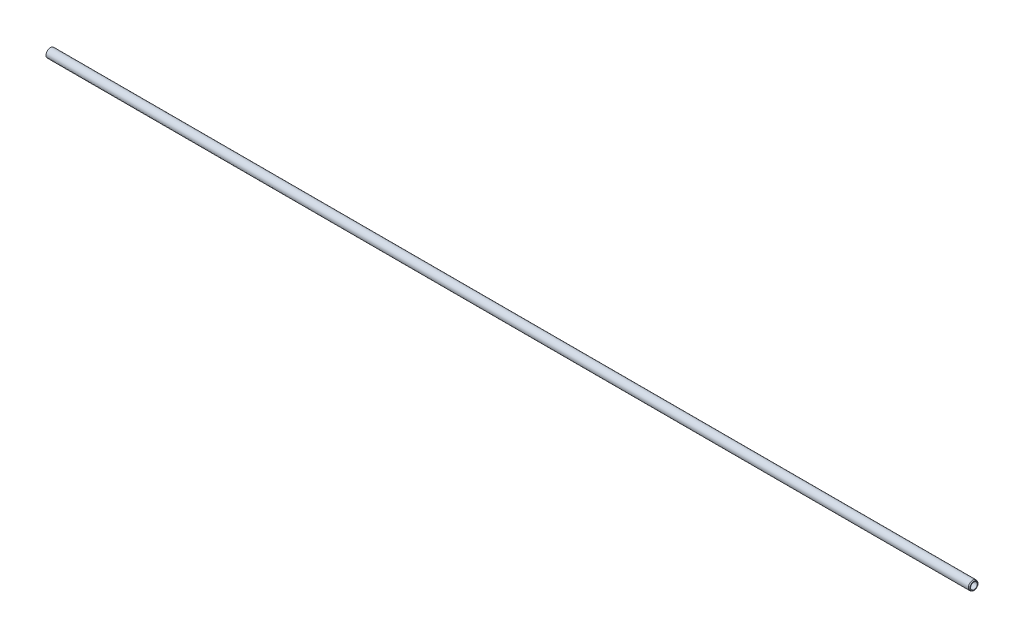
ISO-10303-21;
HEADER;
FILE_DESCRIPTION(('STEP AP214'),'2;1');
FILE_NAME('part.step','',(''),(''),'','','');
FILE_SCHEMA(('AUTOMOTIVE_DESIGN { 1 0 10303 214 1 1 1 1 }'));
ENDSEC;
DATA;
#1=APPLICATION_CONTEXT('core data for automotive mechanical design processes');
#2=APPLICATION_PROTOCOL_DEFINITION('international standard','automotive_design',2000,#1);
#3=PRODUCT_CONTEXT('',#1,'mechanical');
#4=PRODUCT('Part','Part','',(#3));
#5=PRODUCT_RELATED_PRODUCT_CATEGORY('part','',(#4));
#6=PRODUCT_DEFINITION_FORMATION('','',#4);
#7=PRODUCT_DEFINITION_CONTEXT('part definition',#1,'design');
#8=PRODUCT_DEFINITION('design','',#6,#7);
#9=PRODUCT_DEFINITION_SHAPE('','',#8);
#10=(LENGTH_UNIT() NAMED_UNIT(*) SI_UNIT(.MILLI.,.METRE.));
#11=(NAMED_UNIT(*) PLANE_ANGLE_UNIT() SI_UNIT($,.RADIAN.));
#12=(NAMED_UNIT(*) SI_UNIT($,.STERADIAN.) SOLID_ANGLE_UNIT());
#13=UNCERTAINTY_MEASURE_WITH_UNIT(LENGTH_MEASURE(1.E-05),#10,'distance_accuracy_value','');
#14=(GEOMETRIC_REPRESENTATION_CONTEXT(3) GLOBAL_UNCERTAINTY_ASSIGNED_CONTEXT((#13)) GLOBAL_UNIT_ASSIGNED_CONTEXT((#10,
#11,#12)) REPRESENTATION_CONTEXT('',''));
#15=CARTESIAN_POINT('',(0.,0.,0.));
#16=DIRECTION('',(0.,0.,1.));
#17=DIRECTION('',(1.,0.,0.));
#18=AXIS2_PLACEMENT_3D('',#15,#16,#17);
#19=CARTESIAN_POINT('',(0.,0.,0.));
#20=DIRECTION('',(-1.,0.,0.));
#21=DIRECTION('',(0.,0.,1.));
#22=AXIS2_PLACEMENT_3D('',#19,#20,#21);
#23=CYLINDRICAL_SURFACE('',#22,10.);
#24=CARTESIAN_POINT('',(2070.5,0.,0.));
#25=DIRECTION('',(-1.,0.,0.));
#26=DIRECTION('',(0.,0.,1.));
#27=AXIS2_PLACEMENT_3D('',#24,#25,#26);
#28=CIRCLE('',#27,10.);
#29=CARTESIAN_POINT('',(2070.5,0.,10.));
#30=VERTEX_POINT('',#29);
#31=EDGE_CURVE('E10',#30,#30,#28,.T.);
#32=ORIENTED_EDGE('',*,*,#31,.T.);
#33=EDGE_LOOP('',(#32));
#34=FACE_BOUND('',#33,.T.);
#35=CARTESIAN_POINT('',(0.,0.,0.));
#36=DIRECTION('',(-1.,0.,0.));
#37=DIRECTION('',(0.,0.,1.));
#38=AXIS2_PLACEMENT_3D('',#35,#36,#37);
#39=CIRCLE('',#38,10.);
#40=CARTESIAN_POINT('',(0.,0.,10.));
#41=VERTEX_POINT('',#40);
#42=EDGE_CURVE('E56',#41,#41,#39,.T.);
#43=ORIENTED_EDGE('',*,*,#42,.F.);
#44=EDGE_LOOP('',(#43));
#45=FACE_BOUND('',#44,.T.);
#46=ADVANCED_FACE('F37',(#34,#45),#23,.T.);
#47=CARTESIAN_POINT('',(2070.5,0.,0.));
#48=DIRECTION('',(-1.,0.,0.));
#49=DIRECTION('',(0.,0.,1.));
#50=AXIS2_PLACEMENT_3D('',#47,#48,#49);
#51=CONICAL_SURFACE('',#50,10.,0.349065850398867);
#52=CARTESIAN_POINT('',(2073.,0.,0.));
#53=DIRECTION('',(-1.,0.,0.));
#54=DIRECTION('',(0.,0.,1.));
#55=AXIS2_PLACEMENT_3D('',#52,#53,#54);
#56=CIRCLE('',#55,9.09007441433451);
#57=CARTESIAN_POINT('',(2073.,0.,9.09007441433451));
#58=VERTEX_POINT('',#57);
#59=EDGE_CURVE('E43',#58,#58,#56,.T.);
#60=ORIENTED_EDGE('',*,*,#59,.T.);
#61=EDGE_LOOP('',(#60));
#62=FACE_BOUND('',#61,.T.);
#63=ORIENTED_EDGE('',*,*,#31,.F.);
#64=EDGE_LOOP('',(#63));
#65=FACE_BOUND('',#64,.T.);
#66=ADVANCED_FACE('F63',(#62,#65),#51,.T.);
#67=CARTESIAN_POINT('',(2073.,9.09007441433451,0.));
#68=DIRECTION('',(1.,0.,0.));
#69=DIRECTION('',(0.,0.,-1.));
#70=AXIS2_PLACEMENT_3D('',#67,#68,#69);
#71=PLANE('',#70);
#72=CARTESIAN_POINT('',(2073.,0.,0.));
#73=DIRECTION('',(-1.,0.,0.));
#74=DIRECTION('',(0.,0.,1.));
#75=AXIS2_PLACEMENT_3D('',#72,#73,#74);
#76=CIRCLE('',#75,7.5);
#77=CARTESIAN_POINT('',(2073.,0.,7.5));
#78=VERTEX_POINT('',#77);
#79=EDGE_CURVE('E47',#78,#78,#76,.T.);
#80=ORIENTED_EDGE('',*,*,#79,.T.);
#81=EDGE_LOOP('',(#80));
#82=FACE_BOUND('',#81,.T.);
#83=ORIENTED_EDGE('',*,*,#59,.F.);
#84=EDGE_LOOP('',(#83));
#85=FACE_BOUND('',#84,.T.);
#86=ADVANCED_FACE('F67',(#82,#85),#71,.T.);
#87=CARTESIAN_POINT('',(0.,0.,0.));
#88=DIRECTION('',(-1.,0.,0.));
#89=DIRECTION('',(0.,0.,1.));
#90=AXIS2_PLACEMENT_3D('',#87,#88,#89);
#91=CYLINDRICAL_SURFACE('',#90,7.5);
#92=ORIENTED_EDGE('',*,*,#79,.F.);
#93=EDGE_LOOP('',(#92));
#94=FACE_BOUND('',#93,.T.);
#95=CARTESIAN_POINT('',(0.,0.,0.));
#96=DIRECTION('',(-1.,0.,0.));
#97=DIRECTION('',(0.,0.,1.));
#98=AXIS2_PLACEMENT_3D('',#95,#96,#97);
#99=CIRCLE('',#98,7.5);
#100=CARTESIAN_POINT('',(0.,0.,7.5));
#101=VERTEX_POINT('',#100);
#102=EDGE_CURVE('E51',#101,#101,#99,.T.);
#103=ORIENTED_EDGE('',*,*,#102,.T.);
#104=EDGE_LOOP('',(#103));
#105=FACE_BOUND('',#104,.T.);
#106=ADVANCED_FACE('F71',(#94,#105),#91,.F.);
#107=CARTESIAN_POINT('',(0.,10.,0.));
#108=DIRECTION('',(1.,0.,0.));
#109=DIRECTION('',(0.,0.,-1.));
#110=AXIS2_PLACEMENT_3D('',#107,#108,#109);
#111=PLANE('',#110);
#112=ORIENTED_EDGE('',*,*,#102,.F.);
#113=EDGE_LOOP('',(#112));
#114=FACE_BOUND('',#113,.T.);
#115=ORIENTED_EDGE('',*,*,#42,.T.);
#116=EDGE_LOOP('',(#115));
#117=FACE_BOUND('',#116,.T.);
#118=ADVANCED_FACE('F60',(#114,#117),#111,.F.);
#119=CLOSED_SHELL('',(#46,#66,#86,#106,#118));
#120=MANIFOLD_SOLID_BREP('B2',#119);
#121=ADVANCED_BREP_SHAPE_REPRESENTATION('',(#18,#120),#14);
#122=SHAPE_DEFINITION_REPRESENTATION(#9,#121);
ENDSEC;
END-ISO-10303-21;
